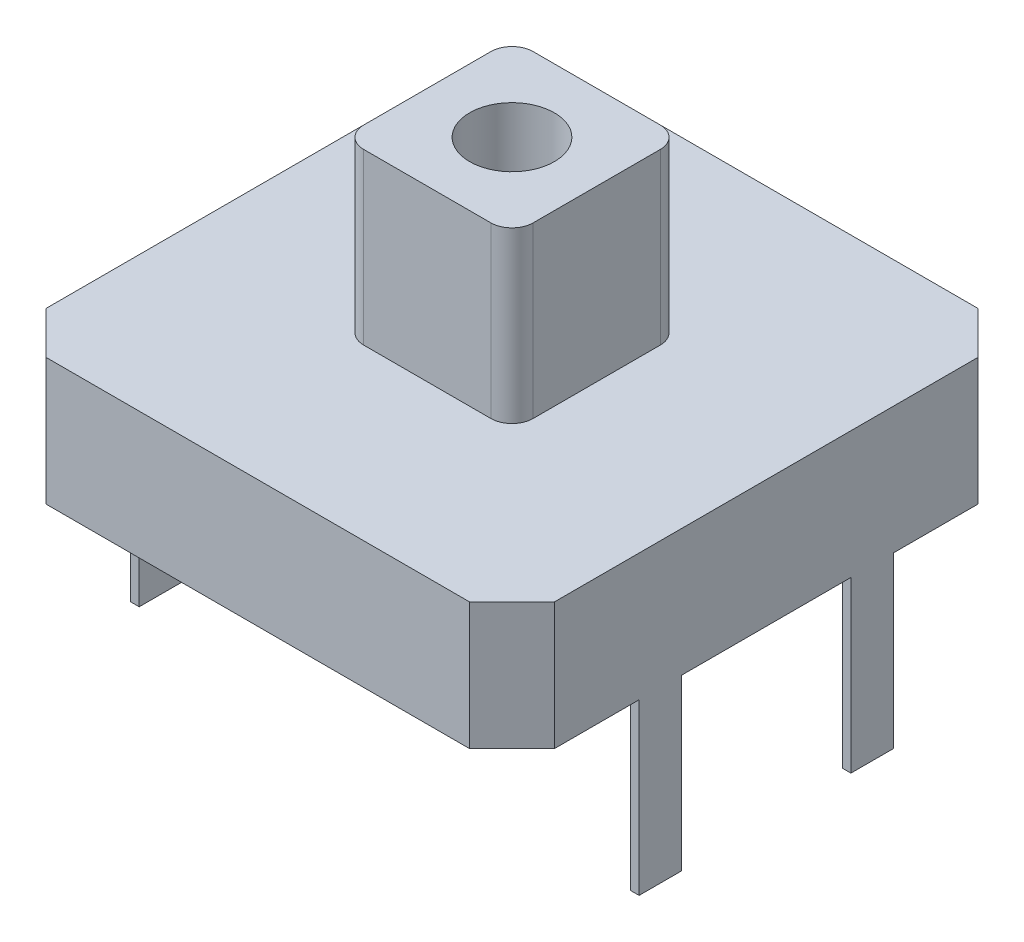
ISO-10303-21;
HEADER;
FILE_DESCRIPTION(('STEP AP214'),'2;1');
FILE_NAME('part.step','',(''),(''),'','','');
FILE_SCHEMA(('AUTOMOTIVE_DESIGN { 1 0 10303 214 1 1 1 1 }'));
ENDSEC;
DATA;
#1=APPLICATION_CONTEXT('core data for automotive mechanical design processes');
#2=APPLICATION_PROTOCOL_DEFINITION('international standard','automotive_design',2000,#1);
#3=PRODUCT_CONTEXT('',#1,'mechanical');
#4=PRODUCT('Part','Part','',(#3));
#5=PRODUCT_RELATED_PRODUCT_CATEGORY('part','',(#4));
#6=PRODUCT_DEFINITION_FORMATION('','',#4);
#7=PRODUCT_DEFINITION_CONTEXT('part definition',#1,'design');
#8=PRODUCT_DEFINITION('design','',#6,#7);
#9=PRODUCT_DEFINITION_SHAPE('','',#8);
#10=(LENGTH_UNIT() NAMED_UNIT(*) SI_UNIT(.MILLI.,.METRE.));
#11=(NAMED_UNIT(*) PLANE_ANGLE_UNIT() SI_UNIT($,.RADIAN.));
#12=(NAMED_UNIT(*) SI_UNIT($,.STERADIAN.) SOLID_ANGLE_UNIT());
#13=UNCERTAINTY_MEASURE_WITH_UNIT(LENGTH_MEASURE(1.E-05),#10,'distance_accuracy_value','');
#14=(GEOMETRIC_REPRESENTATION_CONTEXT(3) GLOBAL_UNCERTAINTY_ASSIGNED_CONTEXT((#13)) GLOBAL_UNIT_ASSIGNED_CONTEXT((#10,
#11,#12)) REPRESENTATION_CONTEXT('',''));
#15=CARTESIAN_POINT('',(0.,0.,0.));
#16=DIRECTION('',(0.,0.,1.));
#17=DIRECTION('',(1.,0.,0.));
#18=AXIS2_PLACEMENT_3D('',#15,#16,#17);
#19=CARTESIAN_POINT('',(0.,0.,0.));
#20=DIRECTION('',(0.,-1.,0.));
#21=DIRECTION('',(0.,0.,-1.));
#22=AXIS2_PLACEMENT_3D('',#19,#20,#21);
#23=PLANE('',#22);
#24=DIRECTION('',(1.,0.,0.));
#25=VECTOR('',#24,1.);
#26=CARTESIAN_POINT('',(-6.,0.,6.));
#27=LINE('',#26,#25);
#28=CARTESIAN_POINT('',(-5.,0.,6.));
#29=VERTEX_POINT('',#28);
#30=CARTESIAN_POINT('',(5.,0.,6.));
#31=VERTEX_POINT('',#30);
#32=EDGE_CURVE('E307',#29,#31,#27,.T.);
#33=ORIENTED_EDGE('',*,*,#32,.F.);
#34=DIRECTION('',(0.707106781186546,0.,0.707106781186549));
#35=VECTOR('',#34,1.);
#36=CARTESIAN_POINT('',(-5.50000000000001,0.,5.49999999999999));
#37=LINE('',#36,#35);
#38=CARTESIAN_POINT('',(-6.,0.,5.));
#39=VERTEX_POINT('',#38);
#40=EDGE_CURVE('E381',#29,#39,#37,.F.);
#41=ORIENTED_EDGE('',*,*,#40,.T.);
#42=DIRECTION('',(0.,0.,1.));
#43=VECTOR('',#42,1.);
#44=CARTESIAN_POINT('',(-6.,0.,6.));
#45=LINE('',#44,#43);
#46=CARTESIAN_POINT('',(-6.,0.,3.));
#47=VERTEX_POINT('',#46);
#48=EDGE_CURVE('E303',#47,#39,#45,.T.);
#49=ORIENTED_EDGE('',*,*,#48,.F.);
#50=DIRECTION('',(-1.,0.,0.));
#51=VECTOR('',#50,1.);
#52=CARTESIAN_POINT('',(-6.,0.,3.));
#53=LINE('',#52,#51);
#54=CARTESIAN_POINT('',(-5.8,0.,3.));
#55=VERTEX_POINT('',#54);
#56=EDGE_CURVE('E501',#55,#47,#53,.T.);
#57=ORIENTED_EDGE('',*,*,#56,.F.);
#58=DIRECTION('',(0.,0.,1.));
#59=VECTOR('',#58,1.);
#60=CARTESIAN_POINT('',(-5.8,0.,2.));
#61=LINE('',#60,#59);
#62=CARTESIAN_POINT('',(-5.8,0.,2.));
#63=VERTEX_POINT('',#62);
#64=EDGE_CURVE('E505',#63,#55,#61,.T.);
#65=ORIENTED_EDGE('',*,*,#64,.F.);
#66=DIRECTION('',(1.,0.,0.));
#67=VECTOR('',#66,1.);
#68=CARTESIAN_POINT('',(-6.,0.,2.));
#69=LINE('',#68,#67);
#70=CARTESIAN_POINT('',(-6.,0.,2.));
#71=VERTEX_POINT('',#70);
#72=EDGE_CURVE('E496',#71,#63,#69,.T.);
#73=ORIENTED_EDGE('',*,*,#72,.F.);
#74=CARTESIAN_POINT('',(-6.,0.,-2.));
#75=VERTEX_POINT('',#74);
#76=EDGE_CURVE('E308',#75,#71,#45,.T.);
#77=ORIENTED_EDGE('',*,*,#76,.F.);
#78=DIRECTION('',(-1.,0.,0.));
#79=VECTOR('',#78,1.);
#80=CARTESIAN_POINT('',(-6.,0.,-2.));
#81=LINE('',#80,#79);
#82=CARTESIAN_POINT('',(-5.8,0.,-2.));
#83=VERTEX_POINT('',#82);
#84=EDGE_CURVE('E525',#83,#75,#81,.T.);
#85=ORIENTED_EDGE('',*,*,#84,.F.);
#86=DIRECTION('',(0.,0.,1.));
#87=VECTOR('',#86,1.);
#88=CARTESIAN_POINT('',(-5.8,0.,-2.));
#89=LINE('',#88,#87);
#90=CARTESIAN_POINT('',(-5.8,0.,-3.));
#91=VERTEX_POINT('',#90);
#92=EDGE_CURVE('E538',#91,#83,#89,.T.);
#93=ORIENTED_EDGE('',*,*,#92,.F.);
#94=DIRECTION('',(1.,0.,0.));
#95=VECTOR('',#94,1.);
#96=CARTESIAN_POINT('',(-6.,0.,-3.));
#97=LINE('',#96,#95);
#98=CARTESIAN_POINT('',(-6.,0.,-3.));
#99=VERTEX_POINT('',#98);
#100=EDGE_CURVE('E509',#99,#91,#97,.T.);
#101=ORIENTED_EDGE('',*,*,#100,.F.);
#102=CARTESIAN_POINT('',(-6.,0.,-5.));
#103=VERTEX_POINT('',#102);
#104=EDGE_CURVE('E304',#103,#99,#45,.T.);
#105=ORIENTED_EDGE('',*,*,#104,.F.);
#106=DIRECTION('',(-0.707106781186549,0.,0.707106781186546));
#107=VECTOR('',#106,1.);
#108=CARTESIAN_POINT('',(-5.49999999999999,0.,-5.50000000000001));
#109=LINE('',#108,#107);
#110=CARTESIAN_POINT('',(-4.99999999999999,0.,-6.));
#111=VERTEX_POINT('',#110);
#112=EDGE_CURVE('E375',#103,#111,#109,.F.);
#113=ORIENTED_EDGE('',*,*,#112,.T.);
#114=DIRECTION('',(-1.,0.,0.));
#115=VECTOR('',#114,1.);
#116=CARTESIAN_POINT('',(-6.,0.,-6.));
#117=LINE('',#116,#115);
#118=CARTESIAN_POINT('',(5.,0.,-6.));
#119=VERTEX_POINT('',#118);
#120=EDGE_CURVE('E294',#119,#111,#117,.T.);
#121=ORIENTED_EDGE('',*,*,#120,.F.);
#122=DIRECTION('',(-0.707106781186546,0.,-0.707106781186549));
#123=VECTOR('',#122,1.);
#124=CARTESIAN_POINT('',(5.50000000000001,0.,-5.49999999999999));
#125=LINE('',#124,#123);
#126=CARTESIAN_POINT('',(6.,0.,-5.));
#127=VERTEX_POINT('',#126);
#128=EDGE_CURVE('E372',#119,#127,#125,.F.);
#129=ORIENTED_EDGE('',*,*,#128,.T.);
#130=DIRECTION('',(0.,0.,-1.));
#131=VECTOR('',#130,1.);
#132=CARTESIAN_POINT('',(6.,0.,6.));
#133=LINE('',#132,#131);
#134=CARTESIAN_POINT('',(6.,0.,-3.));
#135=VERTEX_POINT('',#134);
#136=EDGE_CURVE('E290',#135,#127,#133,.T.);
#137=ORIENTED_EDGE('',*,*,#136,.F.);
#138=DIRECTION('',(1.,0.,0.));
#139=VECTOR('',#138,1.);
#140=CARTESIAN_POINT('',(6.,0.,-3.));
#141=LINE('',#140,#139);
#142=CARTESIAN_POINT('',(5.8,0.,-3.));
#143=VERTEX_POINT('',#142);
#144=EDGE_CURVE('E594',#143,#135,#141,.T.);
#145=ORIENTED_EDGE('',*,*,#144,.F.);
#146=DIRECTION('',(0.,0.,-1.));
#147=VECTOR('',#146,1.);
#148=CARTESIAN_POINT('',(5.8,0.,-2.));
#149=LINE('',#148,#147);
#150=CARTESIAN_POINT('',(5.8,0.,-2.));
#151=VERTEX_POINT('',#150);
#152=EDGE_CURVE('E278',#151,#143,#149,.T.);
#153=ORIENTED_EDGE('',*,*,#152,.F.);
#154=DIRECTION('',(-1.,0.,0.));
#155=VECTOR('',#154,1.);
#156=CARTESIAN_POINT('',(6.,0.,-2.));
#157=LINE('',#156,#155);
#158=CARTESIAN_POINT('',(6.,0.,-2.));
#159=VERTEX_POINT('',#158);
#160=EDGE_CURVE('E261',#159,#151,#157,.T.);
#161=ORIENTED_EDGE('',*,*,#160,.F.);
#162=CARTESIAN_POINT('',(6.,0.,2.));
#163=VERTEX_POINT('',#162);
#164=EDGE_CURVE('E276',#163,#159,#133,.T.);
#165=ORIENTED_EDGE('',*,*,#164,.F.);
#166=DIRECTION('',(1.,0.,0.));
#167=VECTOR('',#166,1.);
#168=CARTESIAN_POINT('',(6.,0.,2.));
#169=LINE('',#168,#167);
#170=CARTESIAN_POINT('',(5.8,0.,2.));
#171=VERTEX_POINT('',#170);
#172=EDGE_CURVE('E562',#171,#163,#169,.T.);
#173=ORIENTED_EDGE('',*,*,#172,.F.);
#174=DIRECTION('',(0.,0.,-1.));
#175=VECTOR('',#174,1.);
#176=CARTESIAN_POINT('',(5.8,0.,2.));
#177=LINE('',#176,#175);
#178=CARTESIAN_POINT('',(5.8,0.,3.));
#179=VERTEX_POINT('',#178);
#180=EDGE_CURVE('E574',#179,#171,#177,.T.);
#181=ORIENTED_EDGE('',*,*,#180,.F.);
#182=DIRECTION('',(-1.,0.,0.));
#183=VECTOR('',#182,1.);
#184=CARTESIAN_POINT('',(6.,0.,3.));
#185=LINE('',#184,#183);
#186=CARTESIAN_POINT('',(6.,0.,3.));
#187=VERTEX_POINT('',#186);
#188=EDGE_CURVE('E557',#187,#179,#185,.T.);
#189=ORIENTED_EDGE('',*,*,#188,.F.);
#190=CARTESIAN_POINT('',(6.,0.,5.));
#191=VERTEX_POINT('',#190);
#192=EDGE_CURVE('E289',#191,#187,#133,.T.);
#193=ORIENTED_EDGE('',*,*,#192,.F.);
#194=DIRECTION('',(0.707106781186549,0.,-0.707106781186546));
#195=VECTOR('',#194,1.);
#196=CARTESIAN_POINT('',(5.49999999999999,0.,5.50000000000001));
#197=LINE('',#196,#195);
#198=EDGE_CURVE('E378',#191,#31,#197,.F.);
#199=ORIENTED_EDGE('',*,*,#198,.T.);
#200=EDGE_LOOP('',(#33,#41,#49,#57,#65,#73,#77,#85,#93,#101,#105,#113,#121,#129,#137,#145,#153,
#161,#165,#173,#181,#189,#193,#199));
#201=FACE_BOUND('',#200,.T.);
#202=ADVANCED_FACE('F45',(#201),#23,.T.);
#203=CARTESIAN_POINT('',(0.,3.,0.));
#204=DIRECTION('',(0.,-1.,0.));
#205=DIRECTION('',(0.,0.,-1.));
#206=AXIS2_PLACEMENT_3D('',#203,#204,#205);
#207=PLANE('',#206);
#208=DIRECTION('',(0.,0.,1.));
#209=VECTOR('',#208,1.);
#210=CARTESIAN_POINT('',(-6.,3.,6.));
#211=LINE('',#210,#209);
#212=CARTESIAN_POINT('',(-6.,3.,-5.));
#213=VERTEX_POINT('',#212);
#214=CARTESIAN_POINT('',(-6.,3.,5.));
#215=VERTEX_POINT('',#214);
#216=EDGE_CURVE('E429',#213,#215,#211,.T.);
#217=ORIENTED_EDGE('',*,*,#216,.T.);
#218=DIRECTION('',(-0.707106781186546,0.,-0.707106781186549));
#219=VECTOR('',#218,1.);
#220=CARTESIAN_POINT('',(-5.,3.,6.));
#221=LINE('',#220,#219);
#222=CARTESIAN_POINT('',(-5.,3.,6.));
#223=VERTEX_POINT('',#222);
#224=EDGE_CURVE('E399',#215,#223,#221,.F.);
#225=ORIENTED_EDGE('',*,*,#224,.T.);
#226=DIRECTION('',(1.,0.,0.));
#227=VECTOR('',#226,1.);
#228=CARTESIAN_POINT('',(-6.,3.,6.));
#229=LINE('',#228,#227);
#230=CARTESIAN_POINT('',(5.,3.,6.));
#231=VERTEX_POINT('',#230);
#232=EDGE_CURVE('E299',#223,#231,#229,.T.);
#233=ORIENTED_EDGE('',*,*,#232,.T.);
#234=DIRECTION('',(-0.707106781186549,0.,0.707106781186546));
#235=VECTOR('',#234,1.);
#236=CARTESIAN_POINT('',(6.,3.,5.));
#237=LINE('',#236,#235);
#238=CARTESIAN_POINT('',(6.,3.,5.));
#239=VERTEX_POINT('',#238);
#240=EDGE_CURVE('E396',#231,#239,#237,.F.);
#241=ORIENTED_EDGE('',*,*,#240,.T.);
#242=DIRECTION('',(0.,0.,-1.));
#243=VECTOR('',#242,1.);
#244=CARTESIAN_POINT('',(6.,3.,6.));
#245=LINE('',#244,#243);
#246=CARTESIAN_POINT('',(6.,3.,-5.));
#247=VERTEX_POINT('',#246);
#248=EDGE_CURVE('E312',#239,#247,#245,.T.);
#249=ORIENTED_EDGE('',*,*,#248,.T.);
#250=DIRECTION('',(0.707106781186546,0.,0.707106781186549));
#251=VECTOR('',#250,1.);
#252=CARTESIAN_POINT('',(5.,3.,-6.));
#253=LINE('',#252,#251);
#254=CARTESIAN_POINT('',(5.,3.,-6.));
#255=VERTEX_POINT('',#254);
#256=EDGE_CURVE('E67',#247,#255,#253,.F.);
#257=ORIENTED_EDGE('',*,*,#256,.T.);
#258=DIRECTION('',(-1.,0.,0.));
#259=VECTOR('',#258,1.);
#260=CARTESIAN_POINT('',(-6.,3.,-6.));
#261=LINE('',#260,#259);
#262=CARTESIAN_POINT('',(-4.99999999999999,3.,-6.));
#263=VERTEX_POINT('',#262);
#264=EDGE_CURVE('E413',#255,#263,#261,.T.);
#265=ORIENTED_EDGE('',*,*,#264,.T.);
#266=DIRECTION('',(0.707106781186549,0.,-0.707106781186546));
#267=VECTOR('',#266,1.);
#268=CARTESIAN_POINT('',(-6.,3.,-5.));
#269=LINE('',#268,#267);
#270=EDGE_CURVE('E393',#263,#213,#269,.F.);
#271=ORIENTED_EDGE('',*,*,#270,.T.);
#272=EDGE_LOOP('',(#217,#225,#233,#241,#249,#257,#265,#271));
#273=FACE_BOUND('',#272,.T.);
#274=DIRECTION('',(0.,0.,-1.));
#275=VECTOR('',#274,1.);
#276=CARTESIAN_POINT('',(2.,3.,2.));
#277=LINE('',#276,#275);
#278=CARTESIAN_POINT('',(2.,3.,1.5));
#279=VERTEX_POINT('',#278);
#280=CARTESIAN_POINT('',(2.,3.,-1.5));
#281=VERTEX_POINT('',#280);
#282=EDGE_CURVE('E453',#279,#281,#277,.T.);
#283=ORIENTED_EDGE('',*,*,#282,.F.);
#284=CARTESIAN_POINT('',(1.5,3.,1.5));
#285=DIRECTION('',(0.,-1.,0.));
#286=DIRECTION('',(0.,0.,-1.));
#287=AXIS2_PLACEMENT_3D('',#284,#285,#286);
#288=CIRCLE('',#287,0.5);
#289=CARTESIAN_POINT('',(1.5,3.,2.));
#290=VERTEX_POINT('',#289);
#291=EDGE_CURVE('E362',#279,#290,#288,.T.);
#292=ORIENTED_EDGE('',*,*,#291,.T.);
#293=DIRECTION('',(1.,0.,0.));
#294=VECTOR('',#293,1.);
#295=CARTESIAN_POINT('',(-2.,3.,2.));
#296=LINE('',#295,#294);
#297=CARTESIAN_POINT('',(-1.5,3.,2.));
#298=VERTEX_POINT('',#297);
#299=EDGE_CURVE('E440',#298,#290,#296,.T.);
#300=ORIENTED_EDGE('',*,*,#299,.F.);
#301=CARTESIAN_POINT('',(-1.5,3.,1.5));
#302=DIRECTION('',(0.,-1.,0.));
#303=DIRECTION('',(0.,0.,-1.));
#304=AXIS2_PLACEMENT_3D('',#301,#302,#303);
#305=CIRCLE('',#304,0.5);
#306=CARTESIAN_POINT('',(-2.,3.,1.5));
#307=VERTEX_POINT('',#306);
#308=EDGE_CURVE('E359',#298,#307,#305,.T.);
#309=ORIENTED_EDGE('',*,*,#308,.T.);
#310=DIRECTION('',(0.,0.,1.));
#311=VECTOR('',#310,1.);
#312=CARTESIAN_POINT('',(-2.,3.,2.));
#313=LINE('',#312,#311);
#314=CARTESIAN_POINT('',(-2.,3.,-1.5));
#315=VERTEX_POINT('',#314);
#316=EDGE_CURVE('E445',#315,#307,#313,.T.);
#317=ORIENTED_EDGE('',*,*,#316,.F.);
#318=CARTESIAN_POINT('',(-1.5,3.,-1.5));
#319=DIRECTION('',(0.,-1.,0.));
#320=DIRECTION('',(0.,0.,-1.));
#321=AXIS2_PLACEMENT_3D('',#318,#319,#320);
#322=CIRCLE('',#321,0.5);
#323=CARTESIAN_POINT('',(-1.5,3.,-2.));
#324=VERTEX_POINT('',#323);
#325=EDGE_CURVE('E356',#315,#324,#322,.T.);
#326=ORIENTED_EDGE('',*,*,#325,.T.);
#327=DIRECTION('',(-1.,0.,0.));
#328=VECTOR('',#327,1.);
#329=CARTESIAN_POINT('',(-2.,3.,-2.));
#330=LINE('',#329,#328);
#331=CARTESIAN_POINT('',(1.5,3.,-2.));
#332=VERTEX_POINT('',#331);
#333=EDGE_CURVE('E449',#332,#324,#330,.T.);
#334=ORIENTED_EDGE('',*,*,#333,.F.);
#335=CARTESIAN_POINT('',(1.5,3.,-1.5));
#336=DIRECTION('',(0.,-1.,0.));
#337=DIRECTION('',(0.,0.,-1.));
#338=AXIS2_PLACEMENT_3D('',#335,#336,#337);
#339=CIRCLE('',#338,0.5);
#340=EDGE_CURVE('E353',#332,#281,#339,.T.);
#341=ORIENTED_EDGE('',*,*,#340,.T.);
#342=EDGE_LOOP('',(#283,#292,#300,#309,#317,#326,#334,#341));
#343=FACE_BOUND('',#342,.T.);
#344=ADVANCED_FACE('F636',(#273,#343),#207,.F.);
#345=CARTESIAN_POINT('',(6.,3.,6.));
#346=DIRECTION('',(-1.,0.,0.));
#347=DIRECTION('',(0.,0.,1.));
#348=AXIS2_PLACEMENT_3D('',#345,#346,#347);
#349=PLANE('',#348);
#350=ORIENTED_EDGE('',*,*,#248,.F.);
#351=DIRECTION('',(0.,-1.,0.));
#352=VECTOR('',#351,1.);
#353=CARTESIAN_POINT('',(6.,3.,5.));
#354=LINE('',#353,#352);
#355=EDGE_CURVE('E405',#239,#191,#354,.T.);
#356=ORIENTED_EDGE('',*,*,#355,.T.);
#357=ORIENTED_EDGE('',*,*,#192,.T.);
#358=DIRECTION('',(0.,1.,0.));
#359=VECTOR('',#358,1.);
#360=CARTESIAN_POINT('',(6.,-4.,3.));
#361=LINE('',#360,#359);
#362=CARTESIAN_POINT('',(6.,-4.,3.));
#363=VERTEX_POINT('',#362);
#364=EDGE_CURVE('E280',#363,#187,#361,.T.);
#365=ORIENTED_EDGE('',*,*,#364,.F.);
#366=DIRECTION('',(0.,0.,1.));
#367=VECTOR('',#366,1.);
#368=CARTESIAN_POINT('',(6.,-4.,2.));
#369=LINE('',#368,#367);
#370=CARTESIAN_POINT('',(6.,-4.,2.));
#371=VERTEX_POINT('',#370);
#372=EDGE_CURVE('E558',#371,#363,#369,.T.);
#373=ORIENTED_EDGE('',*,*,#372,.F.);
#374=DIRECTION('',(0.,1.,0.));
#375=VECTOR('',#374,1.);
#376=CARTESIAN_POINT('',(6.,-4.,2.));
#377=LINE('',#376,#375);
#378=EDGE_CURVE('E286',#371,#163,#377,.T.);
#379=ORIENTED_EDGE('',*,*,#378,.T.);
#380=ORIENTED_EDGE('',*,*,#164,.T.);
#381=DIRECTION('',(0.,1.,0.));
#382=VECTOR('',#381,1.);
#383=CARTESIAN_POINT('',(6.,-4.,-2.));
#384=LINE('',#383,#382);
#385=CARTESIAN_POINT('',(6.,-4.,-2.));
#386=VERTEX_POINT('',#385);
#387=EDGE_CURVE('E257',#386,#159,#384,.T.);
#388=ORIENTED_EDGE('',*,*,#387,.F.);
#389=DIRECTION('',(0.,0.,1.));
#390=VECTOR('',#389,1.);
#391=CARTESIAN_POINT('',(6.,-4.,-2.));
#392=LINE('',#391,#390);
#393=CARTESIAN_POINT('',(6.,-4.,-3.));
#394=VERTEX_POINT('',#393);
#395=EDGE_CURVE('E269',#394,#386,#392,.T.);
#396=ORIENTED_EDGE('',*,*,#395,.F.);
#397=DIRECTION('',(0.,1.,0.));
#398=VECTOR('',#397,1.);
#399=CARTESIAN_POINT('',(6.,-4.,-3.));
#400=LINE('',#399,#398);
#401=EDGE_CURVE('E270',#394,#135,#400,.T.);
#402=ORIENTED_EDGE('',*,*,#401,.T.);
#403=ORIENTED_EDGE('',*,*,#136,.T.);
#404=DIRECTION('',(0.,1.,0.));
#405=VECTOR('',#404,1.);
#406=CARTESIAN_POINT('',(6.,3.,-5.));
#407=LINE('',#406,#405);
#408=EDGE_CURVE('E402',#127,#247,#407,.T.);
#409=ORIENTED_EDGE('',*,*,#408,.T.);
#410=EDGE_LOOP('',(#350,#356,#357,#365,#373,#379,#380,#388,#396,#402,#403,#409));
#411=FACE_BOUND('',#410,.T.);
#412=ADVANCED_FACE('F283',(#411),#349,.F.);
#413=CARTESIAN_POINT('',(-6.,3.,-6.));
#414=DIRECTION('',(0.,0.,1.));
#415=DIRECTION('',(1.,0.,0.));
#416=AXIS2_PLACEMENT_3D('',#413,#414,#415);
#417=PLANE('',#416);
#418=ORIENTED_EDGE('',*,*,#120,.T.);
#419=DIRECTION('',(0.,1.,0.));
#420=VECTOR('',#419,1.);
#421=CARTESIAN_POINT('',(-4.99999999999999,3.,-6.));
#422=LINE('',#421,#420);
#423=EDGE_CURVE('E11',#111,#263,#422,.T.);
#424=ORIENTED_EDGE('',*,*,#423,.T.);
#425=ORIENTED_EDGE('',*,*,#264,.F.);
#426=DIRECTION('',(0.,-1.,0.));
#427=VECTOR('',#426,1.);
#428=CARTESIAN_POINT('',(5.,3.,-6.));
#429=LINE('',#428,#427);
#430=EDGE_CURVE('E55',#255,#119,#429,.T.);
#431=ORIENTED_EDGE('',*,*,#430,.T.);
#432=EDGE_LOOP('',(#418,#424,#425,#431));
#433=FACE_BOUND('',#432,.T.);
#434=ADVANCED_FACE('F412',(#433),#417,.F.);
#435=CARTESIAN_POINT('',(-6.,3.,6.));
#436=DIRECTION('',(1.,0.,0.));
#437=DIRECTION('',(0.,0.,-1.));
#438=AXIS2_PLACEMENT_3D('',#435,#436,#437);
#439=PLANE('',#438);
#440=ORIENTED_EDGE('',*,*,#48,.T.);
#441=DIRECTION('',(0.,1.,0.));
#442=VECTOR('',#441,1.);
#443=CARTESIAN_POINT('',(-6.,3.,5.));
#444=LINE('',#443,#442);
#445=EDGE_CURVE('E388',#39,#215,#444,.T.);
#446=ORIENTED_EDGE('',*,*,#445,.T.);
#447=ORIENTED_EDGE('',*,*,#216,.F.);
#448=DIRECTION('',(0.,-1.,0.));
#449=VECTOR('',#448,1.);
#450=CARTESIAN_POINT('',(-6.,3.,-5.));
#451=LINE('',#450,#449);
#452=EDGE_CURVE('E384',#213,#103,#451,.T.);
#453=ORIENTED_EDGE('',*,*,#452,.T.);
#454=ORIENTED_EDGE('',*,*,#104,.T.);
#455=DIRECTION('',(0.,1.,0.));
#456=VECTOR('',#455,1.);
#457=CARTESIAN_POINT('',(-6.,-4.,-3.));
#458=LINE('',#457,#456);
#459=CARTESIAN_POINT('',(-6.,-4.,-3.));
#460=VERTEX_POINT('',#459);
#461=EDGE_CURVE('E554',#460,#99,#458,.T.);
#462=ORIENTED_EDGE('',*,*,#461,.F.);
#463=DIRECTION('',(0.,0.,-1.));
#464=VECTOR('',#463,1.);
#465=CARTESIAN_POINT('',(-6.,-4.,-2.));
#466=LINE('',#465,#464);
#467=CARTESIAN_POINT('',(-6.,-4.,-2.));
#468=VERTEX_POINT('',#467);
#469=EDGE_CURVE('E521',#468,#460,#466,.T.);
#470=ORIENTED_EDGE('',*,*,#469,.F.);
#471=DIRECTION('',(0.,1.,0.));
#472=VECTOR('',#471,1.);
#473=CARTESIAN_POINT('',(-6.,-4.,-2.));
#474=LINE('',#473,#472);
#475=EDGE_CURVE('E535',#468,#75,#474,.T.);
#476=ORIENTED_EDGE('',*,*,#475,.T.);
#477=ORIENTED_EDGE('',*,*,#76,.T.);
#478=DIRECTION('',(0.,1.,0.));
#479=VECTOR('',#478,1.);
#480=CARTESIAN_POINT('',(-6.,-4.,2.));
#481=LINE('',#480,#479);
#482=CARTESIAN_POINT('',(-6.,-4.,2.));
#483=VERTEX_POINT('',#482);
#484=EDGE_CURVE('E487',#483,#71,#481,.T.);
#485=ORIENTED_EDGE('',*,*,#484,.F.);
#486=DIRECTION('',(0.,0.,-1.));
#487=VECTOR('',#486,1.);
#488=CARTESIAN_POINT('',(-6.,-4.,2.));
#489=LINE('',#488,#487);
#490=CARTESIAN_POINT('',(-6.,-4.,3.));
#491=VERTEX_POINT('',#490);
#492=EDGE_CURVE('E512',#491,#483,#489,.T.);
#493=ORIENTED_EDGE('',*,*,#492,.F.);
#494=DIRECTION('',(0.,1.,0.));
#495=VECTOR('',#494,1.);
#496=CARTESIAN_POINT('',(-6.,-4.,3.));
#497=LINE('',#496,#495);
#498=EDGE_CURVE('E483',#491,#47,#497,.T.);
#499=ORIENTED_EDGE('',*,*,#498,.T.);
#500=EDGE_LOOP('',(#440,#446,#447,#453,#454,#462,#470,#476,#477,#485,#493,#499));
#501=FACE_BOUND('',#500,.T.);
#502=ADVANCED_FACE('F425',(#501),#439,.F.);
#503=CARTESIAN_POINT('',(-6.,3.,6.));
#504=DIRECTION('',(0.,0.,-1.));
#505=DIRECTION('',(-1.,0.,0.));
#506=AXIS2_PLACEMENT_3D('',#503,#504,#505);
#507=PLANE('',#506);
#508=ORIENTED_EDGE('',*,*,#232,.F.);
#509=DIRECTION('',(0.,-1.,0.));
#510=VECTOR('',#509,1.);
#511=CARTESIAN_POINT('',(-5.,3.,6.));
#512=LINE('',#511,#510);
#513=EDGE_CURVE('E368',#223,#29,#512,.T.);
#514=ORIENTED_EDGE('',*,*,#513,.T.);
#515=ORIENTED_EDGE('',*,*,#32,.T.);
#516=DIRECTION('',(0.,1.,0.));
#517=VECTOR('',#516,1.);
#518=CARTESIAN_POINT('',(5.,3.,6.));
#519=LINE('',#518,#517);
#520=EDGE_CURVE('E365',#31,#231,#519,.T.);
#521=ORIENTED_EDGE('',*,*,#520,.T.);
#522=EDGE_LOOP('',(#508,#514,#515,#521));
#523=FACE_BOUND('',#522,.T.);
#524=ADVANCED_FACE('F644',(#523),#507,.F.);
#525=CARTESIAN_POINT('',(2.,7.,2.));
#526=DIRECTION('',(-1.,0.,0.));
#527=DIRECTION('',(0.,0.,1.));
#528=AXIS2_PLACEMENT_3D('',#525,#526,#527);
#529=PLANE('',#528);
#530=ORIENTED_EDGE('',*,*,#282,.T.);
#531=DIRECTION('',(0.,-1.,0.));
#532=VECTOR('',#531,1.);
#533=CARTESIAN_POINT('',(2.,7.,-1.5));
#534=LINE('',#533,#532);
#535=CARTESIAN_POINT('',(2.,7.,-1.5));
#536=VERTEX_POINT('',#535);
#537=EDGE_CURVE('E324',#281,#536,#534,.F.);
#538=ORIENTED_EDGE('',*,*,#537,.T.);
#539=DIRECTION('',(0.,0.,-1.));
#540=VECTOR('',#539,1.);
#541=CARTESIAN_POINT('',(2.,7.,2.));
#542=LINE('',#541,#540);
#543=CARTESIAN_POINT('',(2.,7.,1.5));
#544=VERTEX_POINT('',#543);
#545=EDGE_CURVE('E444',#544,#536,#542,.T.);
#546=ORIENTED_EDGE('',*,*,#545,.F.);
#547=DIRECTION('',(0.,-1.,0.));
#548=VECTOR('',#547,1.);
#549=CARTESIAN_POINT('',(2.,7.,1.5));
#550=LINE('',#549,#548);
#551=EDGE_CURVE('E320',#544,#279,#550,.T.);
#552=ORIENTED_EDGE('',*,*,#551,.T.);
#553=EDGE_LOOP('',(#530,#538,#546,#552));
#554=FACE_BOUND('',#553,.T.);
#555=ADVANCED_FACE('F647',(#554),#529,.F.);
#556=CARTESIAN_POINT('',(-2.,7.,-2.));
#557=DIRECTION('',(0.,0.,1.));
#558=DIRECTION('',(1.,0.,0.));
#559=AXIS2_PLACEMENT_3D('',#556,#557,#558);
#560=PLANE('',#559);
#561=DIRECTION('',(-1.,0.,0.));
#562=VECTOR('',#561,1.);
#563=CARTESIAN_POINT('',(-2.,7.,-2.));
#564=LINE('',#563,#562);
#565=CARTESIAN_POINT('',(1.5,7.,-2.));
#566=VERTEX_POINT('',#565);
#567=CARTESIAN_POINT('',(-1.5,7.,-2.));
#568=VERTEX_POINT('',#567);
#569=EDGE_CURVE('E465',#566,#568,#564,.T.);
#570=ORIENTED_EDGE('',*,*,#569,.F.);
#571=DIRECTION('',(0.,-1.,0.));
#572=VECTOR('',#571,1.);
#573=CARTESIAN_POINT('',(1.5,7.,-2.));
#574=LINE('',#573,#572);
#575=EDGE_CURVE('E316',#566,#332,#574,.T.);
#576=ORIENTED_EDGE('',*,*,#575,.T.);
#577=ORIENTED_EDGE('',*,*,#333,.T.);
#578=DIRECTION('',(0.,-1.,0.));
#579=VECTOR('',#578,1.);
#580=CARTESIAN_POINT('',(-1.5,7.,-2.));
#581=LINE('',#580,#579);
#582=EDGE_CURVE('E313',#324,#568,#581,.F.);
#583=ORIENTED_EDGE('',*,*,#582,.T.);
#584=EDGE_LOOP('',(#570,#576,#577,#583));
#585=FACE_BOUND('',#584,.T.);
#586=ADVANCED_FACE('F774',(#585),#560,.F.);
#587=CARTESIAN_POINT('',(-2.,7.,2.));
#588=DIRECTION('',(1.,0.,0.));
#589=DIRECTION('',(0.,0.,-1.));
#590=AXIS2_PLACEMENT_3D('',#587,#588,#589);
#591=PLANE('',#590);
#592=DIRECTION('',(0.,0.,1.));
#593=VECTOR('',#592,1.);
#594=CARTESIAN_POINT('',(-2.,7.,2.));
#595=LINE('',#594,#593);
#596=CARTESIAN_POINT('',(-2.,7.,-1.5));
#597=VERTEX_POINT('',#596);
#598=CARTESIAN_POINT('',(-2.,7.,1.5));
#599=VERTEX_POINT('',#598);
#600=EDGE_CURVE('E461',#597,#599,#595,.T.);
#601=ORIENTED_EDGE('',*,*,#600,.F.);
#602=DIRECTION('',(0.,-1.,0.));
#603=VECTOR('',#602,1.);
#604=CARTESIAN_POINT('',(-2.,7.,-1.5));
#605=LINE('',#604,#603);
#606=EDGE_CURVE('E342',#597,#315,#605,.T.);
#607=ORIENTED_EDGE('',*,*,#606,.T.);
#608=ORIENTED_EDGE('',*,*,#316,.T.);
#609=DIRECTION('',(0.,-1.,0.));
#610=VECTOR('',#609,1.);
#611=CARTESIAN_POINT('',(-2.,7.,1.5));
#612=LINE('',#611,#610);
#613=EDGE_CURVE('E339',#307,#599,#612,.F.);
#614=ORIENTED_EDGE('',*,*,#613,.T.);
#615=EDGE_LOOP('',(#601,#607,#608,#614));
#616=FACE_BOUND('',#615,.T.);
#617=ADVANCED_FACE('F770',(#616),#591,.F.);
#618=CARTESIAN_POINT('',(-2.,7.,2.));
#619=DIRECTION('',(0.,0.,-1.));
#620=DIRECTION('',(-1.,0.,0.));
#621=AXIS2_PLACEMENT_3D('',#618,#619,#620);
#622=PLANE('',#621);
#623=DIRECTION('',(1.,0.,0.));
#624=VECTOR('',#623,1.);
#625=CARTESIAN_POINT('',(-2.,7.,2.));
#626=LINE('',#625,#624);
#627=CARTESIAN_POINT('',(-1.5,7.,2.));
#628=VERTEX_POINT('',#627);
#629=CARTESIAN_POINT('',(1.5,7.,2.));
#630=VERTEX_POINT('',#629);
#631=EDGE_CURVE('E296',#628,#630,#626,.T.);
#632=ORIENTED_EDGE('',*,*,#631,.F.);
#633=DIRECTION('',(0.,-1.,0.));
#634=VECTOR('',#633,1.);
#635=CARTESIAN_POINT('',(-1.5,7.,2.));
#636=LINE('',#635,#634);
#637=EDGE_CURVE('E349',#628,#298,#636,.T.);
#638=ORIENTED_EDGE('',*,*,#637,.T.);
#639=ORIENTED_EDGE('',*,*,#299,.T.);
#640=DIRECTION('',(0.,-1.,0.));
#641=VECTOR('',#640,1.);
#642=CARTESIAN_POINT('',(1.5,7.,2.));
#643=LINE('',#642,#641);
#644=EDGE_CURVE('E346',#290,#630,#643,.F.);
#645=ORIENTED_EDGE('',*,*,#644,.T.);
#646=EDGE_LOOP('',(#632,#638,#639,#645));
#647=FACE_BOUND('',#646,.T.);
#648=ADVANCED_FACE('F766',(#647),#622,.F.);
#649=CARTESIAN_POINT('',(0.,7.,0.));
#650=DIRECTION('',(0.,-1.,0.));
#651=DIRECTION('',(0.,0.,-1.));
#652=AXIS2_PLACEMENT_3D('',#649,#650,#651);
#653=PLANE('',#652);
#654=CARTESIAN_POINT('',(0.,7.,0.));
#655=DIRECTION('',(0.,1.,0.));
#656=DIRECTION('',(0.,0.,1.));
#657=AXIS2_PLACEMENT_3D('',#654,#655,#656);
#658=CIRCLE('',#657,1.);
#659=CARTESIAN_POINT('',(0.,7.,1.));
#660=VERTEX_POINT('',#659);
#661=EDGE_CURVE('E472',#660,#660,#658,.T.);
#662=ORIENTED_EDGE('',*,*,#661,.F.);
#663=EDGE_LOOP('',(#662));
#664=FACE_BOUND('',#663,.T.);
#665=ORIENTED_EDGE('',*,*,#545,.T.);
#666=CARTESIAN_POINT('',(1.5,7.,-1.5));
#667=DIRECTION('',(0.,-1.,0.));
#668=DIRECTION('',(0.,0.,-1.));
#669=AXIS2_PLACEMENT_3D('',#666,#667,#668);
#670=CIRCLE('',#669,0.5);
#671=EDGE_CURVE('E336',#536,#566,#670,.F.);
#672=ORIENTED_EDGE('',*,*,#671,.T.);
#673=ORIENTED_EDGE('',*,*,#569,.T.);
#674=CARTESIAN_POINT('',(-1.5,7.,-1.5));
#675=DIRECTION('',(0.,-1.,0.));
#676=DIRECTION('',(0.,0.,-1.));
#677=AXIS2_PLACEMENT_3D('',#674,#675,#676);
#678=CIRCLE('',#677,0.5);
#679=EDGE_CURVE('E333',#568,#597,#678,.F.);
#680=ORIENTED_EDGE('',*,*,#679,.T.);
#681=ORIENTED_EDGE('',*,*,#600,.T.);
#682=CARTESIAN_POINT('',(-1.5,7.,1.5));
#683=DIRECTION('',(0.,-1.,0.));
#684=DIRECTION('',(0.,0.,-1.));
#685=AXIS2_PLACEMENT_3D('',#682,#683,#684);
#686=CIRCLE('',#685,0.5);
#687=EDGE_CURVE('E330',#599,#628,#686,.F.);
#688=ORIENTED_EDGE('',*,*,#687,.T.);
#689=ORIENTED_EDGE('',*,*,#631,.T.);
#690=CARTESIAN_POINT('',(1.5,7.,1.5));
#691=DIRECTION('',(0.,-1.,0.));
#692=DIRECTION('',(0.,0.,-1.));
#693=AXIS2_PLACEMENT_3D('',#690,#691,#692);
#694=CIRCLE('',#693,0.5);
#695=EDGE_CURVE('E327',#630,#544,#694,.F.);
#696=ORIENTED_EDGE('',*,*,#695,.T.);
#697=EDGE_LOOP('',(#665,#672,#673,#680,#681,#688,#689,#696));
#698=FACE_BOUND('',#697,.T.);
#699=ADVANCED_FACE('F762',(#664,#698),#653,.F.);
#700=CARTESIAN_POINT('',(0.,4.,0.));
#701=DIRECTION('',(0.,1.,0.));
#702=DIRECTION('',(0.,0.,1.));
#703=AXIS2_PLACEMENT_3D('',#700,#701,#702);
#704=CYLINDRICAL_SURFACE('',#703,1.);
#705=CARTESIAN_POINT('',(0.,4.,0.));
#706=DIRECTION('',(0.,1.,0.));
#707=DIRECTION('',(0.,0.,1.));
#708=AXIS2_PLACEMENT_3D('',#705,#706,#707);
#709=CIRCLE('',#708,1.);
#710=CARTESIAN_POINT('',(0.,4.,1.));
#711=VERTEX_POINT('',#710);
#712=EDGE_CURVE('E457',#711,#711,#709,.T.);
#713=ORIENTED_EDGE('',*,*,#712,.F.);
#714=EDGE_LOOP('',(#713));
#715=FACE_BOUND('',#714,.T.);
#716=ORIENTED_EDGE('',*,*,#661,.T.);
#717=EDGE_LOOP('',(#716));
#718=FACE_BOUND('',#717,.T.);
#719=ADVANCED_FACE('F758',(#715,#718),#704,.F.);
#720=CARTESIAN_POINT('',(0.,4.,0.));
#721=DIRECTION('',(0.,1.,0.));
#722=DIRECTION('',(0.,0.,1.));
#723=AXIS2_PLACEMENT_3D('',#720,#721,#722);
#724=PLANE('',#723);
#725=ORIENTED_EDGE('',*,*,#712,.T.);
#726=EDGE_LOOP('',(#725));
#727=FACE_BOUND('',#726,.T.);
#728=ADVANCED_FACE('F659',(#727),#724,.T.);
#729=CARTESIAN_POINT('',(1.5,7.,-1.5));
#730=DIRECTION('',(0.,-1.,0.));
#731=DIRECTION('',(0.,0.,-1.));
#732=AXIS2_PLACEMENT_3D('',#729,#730,#731);
#733=CYLINDRICAL_SURFACE('',#732,0.5);
#734=ORIENTED_EDGE('',*,*,#671,.F.);
#735=ORIENTED_EDGE('',*,*,#537,.F.);
#736=ORIENTED_EDGE('',*,*,#340,.F.);
#737=ORIENTED_EDGE('',*,*,#575,.F.);
#738=EDGE_LOOP('',(#734,#735,#736,#737));
#739=FACE_BOUND('',#738,.T.);
#740=ADVANCED_FACE('F655',(#739),#733,.T.);
#741=CARTESIAN_POINT('',(-1.5,7.,-1.5));
#742=DIRECTION('',(0.,-1.,0.));
#743=DIRECTION('',(0.,0.,-1.));
#744=AXIS2_PLACEMENT_3D('',#741,#742,#743);
#745=CYLINDRICAL_SURFACE('',#744,0.5);
#746=ORIENTED_EDGE('',*,*,#679,.F.);
#747=ORIENTED_EDGE('',*,*,#582,.F.);
#748=ORIENTED_EDGE('',*,*,#325,.F.);
#749=ORIENTED_EDGE('',*,*,#606,.F.);
#750=EDGE_LOOP('',(#746,#747,#748,#749));
#751=FACE_BOUND('',#750,.T.);
#752=ADVANCED_FACE('F658',(#751),#745,.T.);
#753=CARTESIAN_POINT('',(-1.5,7.,1.5));
#754=DIRECTION('',(0.,-1.,0.));
#755=DIRECTION('',(0.,0.,-1.));
#756=AXIS2_PLACEMENT_3D('',#753,#754,#755);
#757=CYLINDRICAL_SURFACE('',#756,0.5);
#758=ORIENTED_EDGE('',*,*,#687,.F.);
#759=ORIENTED_EDGE('',*,*,#613,.F.);
#760=ORIENTED_EDGE('',*,*,#308,.F.);
#761=ORIENTED_EDGE('',*,*,#637,.F.);
#762=EDGE_LOOP('',(#758,#759,#760,#761));
#763=FACE_BOUND('',#762,.T.);
#764=ADVANCED_FACE('F663',(#763),#757,.T.);
#765=CARTESIAN_POINT('',(1.5,7.,1.5));
#766=DIRECTION('',(0.,-1.,0.));
#767=DIRECTION('',(0.,0.,-1.));
#768=AXIS2_PLACEMENT_3D('',#765,#766,#767);
#769=CYLINDRICAL_SURFACE('',#768,0.5);
#770=ORIENTED_EDGE('',*,*,#695,.F.);
#771=ORIENTED_EDGE('',*,*,#644,.F.);
#772=ORIENTED_EDGE('',*,*,#291,.F.);
#773=ORIENTED_EDGE('',*,*,#551,.F.);
#774=EDGE_LOOP('',(#770,#771,#772,#773));
#775=FACE_BOUND('',#774,.T.);
#776=ADVANCED_FACE('F667',(#775),#769,.T.);
#777=CARTESIAN_POINT('',(-5.8,-4.,2.));
#778=DIRECTION('',(-1.,0.,0.));
#779=DIRECTION('',(0.,0.,1.));
#780=AXIS2_PLACEMENT_3D('',#777,#778,#779);
#781=PLANE('',#780);
#782=ORIENTED_EDGE('',*,*,#64,.T.);
#783=DIRECTION('',(0.,1.,0.));
#784=VECTOR('',#783,1.);
#785=CARTESIAN_POINT('',(-5.8,-4.,3.));
#786=LINE('',#785,#784);
#787=CARTESIAN_POINT('',(-5.8,-4.,3.));
#788=VERTEX_POINT('',#787);
#789=EDGE_CURVE('E476',#788,#55,#786,.T.);
#790=ORIENTED_EDGE('',*,*,#789,.F.);
#791=DIRECTION('',(0.,0.,1.));
#792=VECTOR('',#791,1.);
#793=CARTESIAN_POINT('',(-5.8,-4.,2.));
#794=LINE('',#793,#792);
#795=CARTESIAN_POINT('',(-5.8,-4.,2.));
#796=VERTEX_POINT('',#795);
#797=EDGE_CURVE('E500',#796,#788,#794,.T.);
#798=ORIENTED_EDGE('',*,*,#797,.F.);
#799=DIRECTION('',(0.,1.,0.));
#800=VECTOR('',#799,1.);
#801=CARTESIAN_POINT('',(-5.8,-4.,2.));
#802=LINE('',#801,#800);
#803=EDGE_CURVE('E491',#796,#63,#802,.T.);
#804=ORIENTED_EDGE('',*,*,#803,.T.);
#805=EDGE_LOOP('',(#782,#790,#798,#804));
#806=FACE_BOUND('',#805,.T.);
#807=ADVANCED_FACE('F671',(#806),#781,.F.);
#808=CARTESIAN_POINT('',(-6.,-4.,3.));
#809=DIRECTION('',(0.,0.,-1.));
#810=DIRECTION('',(-1.,0.,0.));
#811=AXIS2_PLACEMENT_3D('',#808,#809,#810);
#812=PLANE('',#811);
#813=ORIENTED_EDGE('',*,*,#56,.T.);
#814=ORIENTED_EDGE('',*,*,#498,.F.);
#815=DIRECTION('',(-1.,0.,0.));
#816=VECTOR('',#815,1.);
#817=CARTESIAN_POINT('',(-6.,-4.,3.));
#818=LINE('',#817,#816);
#819=EDGE_CURVE('E515',#788,#491,#818,.T.);
#820=ORIENTED_EDGE('',*,*,#819,.F.);
#821=ORIENTED_EDGE('',*,*,#789,.T.);
#822=EDGE_LOOP('',(#813,#814,#820,#821));
#823=FACE_BOUND('',#822,.T.);
#824=ADVANCED_FACE('F748',(#823),#812,.F.);
#825=CARTESIAN_POINT('',(-6.,-4.,2.));
#826=DIRECTION('',(0.,0.,1.));
#827=DIRECTION('',(1.,0.,0.));
#828=AXIS2_PLACEMENT_3D('',#825,#826,#827);
#829=PLANE('',#828);
#830=ORIENTED_EDGE('',*,*,#72,.T.);
#831=ORIENTED_EDGE('',*,*,#803,.F.);
#832=DIRECTION('',(1.,0.,0.));
#833=VECTOR('',#832,1.);
#834=CARTESIAN_POINT('',(-6.,-4.,2.));
#835=LINE('',#834,#833);
#836=EDGE_CURVE('E495',#483,#796,#835,.T.);
#837=ORIENTED_EDGE('',*,*,#836,.F.);
#838=ORIENTED_EDGE('',*,*,#484,.T.);
#839=EDGE_LOOP('',(#830,#831,#837,#838));
#840=FACE_BOUND('',#839,.T.);
#841=ADVANCED_FACE('F744',(#840),#829,.F.);
#842=CARTESIAN_POINT('',(0.,-4.,0.));
#843=DIRECTION('',(0.,1.,0.));
#844=DIRECTION('',(0.,0.,1.));
#845=AXIS2_PLACEMENT_3D('',#842,#843,#844);
#846=PLANE('',#845);
#847=ORIENTED_EDGE('',*,*,#797,.T.);
#848=ORIENTED_EDGE('',*,*,#819,.T.);
#849=ORIENTED_EDGE('',*,*,#492,.T.);
#850=ORIENTED_EDGE('',*,*,#836,.T.);
#851=EDGE_LOOP('',(#847,#848,#849,#850));
#852=FACE_BOUND('',#851,.T.);
#853=ADVANCED_FACE('F729',(#852),#846,.F.);
#854=CARTESIAN_POINT('',(-6.,-4.,-3.));
#855=DIRECTION('',(0.,0.,1.));
#856=DIRECTION('',(1.,0.,0.));
#857=AXIS2_PLACEMENT_3D('',#854,#855,#856);
#858=PLANE('',#857);
#859=ORIENTED_EDGE('',*,*,#100,.T.);
#860=DIRECTION('',(0.,1.,0.));
#861=VECTOR('',#860,1.);
#862=CARTESIAN_POINT('',(-5.8,-4.,-3.));
#863=LINE('',#862,#861);
#864=CARTESIAN_POINT('',(-5.8,-4.,-3.));
#865=VERTEX_POINT('',#864);
#866=EDGE_CURVE('E550',#865,#91,#863,.T.);
#867=ORIENTED_EDGE('',*,*,#866,.F.);
#868=DIRECTION('',(1.,0.,0.));
#869=VECTOR('',#868,1.);
#870=CARTESIAN_POINT('',(-6.,-4.,-3.));
#871=LINE('',#870,#869);
#872=EDGE_CURVE('E526',#460,#865,#871,.T.);
#873=ORIENTED_EDGE('',*,*,#872,.F.);
#874=ORIENTED_EDGE('',*,*,#461,.T.);
#875=EDGE_LOOP('',(#859,#867,#873,#874));
#876=FACE_BOUND('',#875,.T.);
#877=ADVANCED_FACE('F725',(#876),#858,.F.);
#878=CARTESIAN_POINT('',(-5.8,-4.,-2.));
#879=DIRECTION('',(-1.,0.,0.));
#880=DIRECTION('',(0.,0.,1.));
#881=AXIS2_PLACEMENT_3D('',#878,#879,#880);
#882=PLANE('',#881);
#883=ORIENTED_EDGE('',*,*,#92,.T.);
#884=DIRECTION('',(0.,1.,0.));
#885=VECTOR('',#884,1.);
#886=CARTESIAN_POINT('',(-5.8,-4.,-2.));
#887=LINE('',#886,#885);
#888=CARTESIAN_POINT('',(-5.8,-4.,-2.));
#889=VERTEX_POINT('',#888);
#890=EDGE_CURVE('E547',#889,#83,#887,.T.);
#891=ORIENTED_EDGE('',*,*,#890,.F.);
#892=DIRECTION('',(0.,0.,1.));
#893=VECTOR('',#892,1.);
#894=CARTESIAN_POINT('',(-5.8,-4.,-2.));
#895=LINE('',#894,#893);
#896=EDGE_CURVE('E529',#865,#889,#895,.T.);
#897=ORIENTED_EDGE('',*,*,#896,.F.);
#898=ORIENTED_EDGE('',*,*,#866,.T.);
#899=EDGE_LOOP('',(#883,#891,#897,#898));
#900=FACE_BOUND('',#899,.T.);
#901=ADVANCED_FACE('F728',(#900),#882,.F.);
#902=CARTESIAN_POINT('',(-6.,-4.,-2.));
#903=DIRECTION('',(0.,0.,-1.));
#904=DIRECTION('',(-1.,0.,0.));
#905=AXIS2_PLACEMENT_3D('',#902,#903,#904);
#906=PLANE('',#905);
#907=ORIENTED_EDGE('',*,*,#84,.T.);
#908=ORIENTED_EDGE('',*,*,#475,.F.);
#909=DIRECTION('',(-1.,0.,0.));
#910=VECTOR('',#909,1.);
#911=CARTESIAN_POINT('',(-6.,-4.,-2.));
#912=LINE('',#911,#910);
#913=EDGE_CURVE('E532',#889,#468,#912,.T.);
#914=ORIENTED_EDGE('',*,*,#913,.F.);
#915=ORIENTED_EDGE('',*,*,#890,.T.);
#916=EDGE_LOOP('',(#907,#908,#914,#915));
#917=FACE_BOUND('',#916,.T.);
#918=ADVANCED_FACE('F733',(#917),#906,.F.);
#919=CARTESIAN_POINT('',(0.,-4.,0.));
#920=DIRECTION('',(0.,-1.,0.));
#921=DIRECTION('',(0.,0.,-1.));
#922=AXIS2_PLACEMENT_3D('',#919,#920,#921);
#923=PLANE('',#922);
#924=ORIENTED_EDGE('',*,*,#469,.T.);
#925=ORIENTED_EDGE('',*,*,#872,.T.);
#926=ORIENTED_EDGE('',*,*,#896,.T.);
#927=ORIENTED_EDGE('',*,*,#913,.T.);
#928=EDGE_LOOP('',(#924,#925,#926,#927));
#929=FACE_BOUND('',#928,.T.);
#930=ADVANCED_FACE('F737',(#929),#923,.T.);
#931=CARTESIAN_POINT('',(6.,-4.,3.));
#932=DIRECTION('',(0.,0.,-1.));
#933=DIRECTION('',(-1.,0.,0.));
#934=AXIS2_PLACEMENT_3D('',#931,#932,#933);
#935=PLANE('',#934);
#936=ORIENTED_EDGE('',*,*,#188,.T.);
#937=DIRECTION('',(0.,1.,0.));
#938=VECTOR('',#937,1.);
#939=CARTESIAN_POINT('',(5.8,-4.,3.));
#940=LINE('',#939,#938);
#941=CARTESIAN_POINT('',(5.8,-4.,3.));
#942=VERTEX_POINT('',#941);
#943=EDGE_CURVE('E585',#942,#179,#940,.T.);
#944=ORIENTED_EDGE('',*,*,#943,.F.);
#945=DIRECTION('',(-1.,0.,0.));
#946=VECTOR('',#945,1.);
#947=CARTESIAN_POINT('',(6.,-4.,3.));
#948=LINE('',#947,#946);
#949=EDGE_CURVE('E563',#363,#942,#948,.T.);
#950=ORIENTED_EDGE('',*,*,#949,.F.);
#951=ORIENTED_EDGE('',*,*,#364,.T.);
#952=EDGE_LOOP('',(#936,#944,#950,#951));
#953=FACE_BOUND('',#952,.T.);
#954=ADVANCED_FACE('F705',(#953),#935,.F.);
#955=CARTESIAN_POINT('',(5.8,-4.,2.));
#956=DIRECTION('',(1.,0.,0.));
#957=DIRECTION('',(0.,0.,-1.));
#958=AXIS2_PLACEMENT_3D('',#955,#956,#957);
#959=PLANE('',#958);
#960=ORIENTED_EDGE('',*,*,#180,.T.);
#961=DIRECTION('',(0.,1.,0.));
#962=VECTOR('',#961,1.);
#963=CARTESIAN_POINT('',(5.8,-4.,2.));
#964=LINE('',#963,#962);
#965=CARTESIAN_POINT('',(5.8,-4.,2.));
#966=VERTEX_POINT('',#965);
#967=EDGE_CURVE('E581',#966,#171,#964,.T.);
#968=ORIENTED_EDGE('',*,*,#967,.F.);
#969=DIRECTION('',(0.,0.,-1.));
#970=VECTOR('',#969,1.);
#971=CARTESIAN_POINT('',(5.8,-4.,2.));
#972=LINE('',#971,#970);
#973=EDGE_CURVE('E566',#942,#966,#972,.T.);
#974=ORIENTED_EDGE('',*,*,#973,.F.);
#975=ORIENTED_EDGE('',*,*,#943,.T.);
#976=EDGE_LOOP('',(#960,#968,#974,#975));
#977=FACE_BOUND('',#976,.T.);
#978=ADVANCED_FACE('F708',(#977),#959,.F.);
#979=CARTESIAN_POINT('',(6.,-4.,2.));
#980=DIRECTION('',(0.,0.,1.));
#981=DIRECTION('',(1.,0.,0.));
#982=AXIS2_PLACEMENT_3D('',#979,#980,#981);
#983=PLANE('',#982);
#984=ORIENTED_EDGE('',*,*,#172,.T.);
#985=ORIENTED_EDGE('',*,*,#378,.F.);
#986=DIRECTION('',(1.,0.,0.));
#987=VECTOR('',#986,1.);
#988=CARTESIAN_POINT('',(6.,-4.,2.));
#989=LINE('',#988,#987);
#990=EDGE_CURVE('E569',#966,#371,#989,.T.);
#991=ORIENTED_EDGE('',*,*,#990,.F.);
#992=ORIENTED_EDGE('',*,*,#967,.T.);
#993=EDGE_LOOP('',(#984,#985,#991,#992));
#994=FACE_BOUND('',#993,.T.);
#995=ADVANCED_FACE('F714',(#994),#983,.F.);
#996=CARTESIAN_POINT('',(0.,-4.,0.));
#997=DIRECTION('',(0.,-1.,0.));
#998=DIRECTION('',(0.,0.,-1.));
#999=AXIS2_PLACEMENT_3D('',#996,#997,#998);
#1000=PLANE('',#999);
#1001=ORIENTED_EDGE('',*,*,#372,.T.);
#1002=ORIENTED_EDGE('',*,*,#949,.T.);
#1003=ORIENTED_EDGE('',*,*,#973,.T.);
#1004=ORIENTED_EDGE('',*,*,#990,.T.);
#1005=EDGE_LOOP('',(#1001,#1002,#1003,#1004));
#1006=FACE_BOUND('',#1005,.T.);
#1007=ADVANCED_FACE('F712',(#1006),#1000,.T.);
#1008=CARTESIAN_POINT('',(6.,-4.,-2.));
#1009=DIRECTION('',(0.,0.,-1.));
#1010=DIRECTION('',(-1.,0.,0.));
#1011=AXIS2_PLACEMENT_3D('',#1008,#1009,#1010);
#1012=PLANE('',#1011);
#1013=ORIENTED_EDGE('',*,*,#160,.T.);
#1014=DIRECTION('',(0.,1.,0.));
#1015=VECTOR('',#1014,1.);
#1016=CARTESIAN_POINT('',(5.8,-4.,-2.));
#1017=LINE('',#1016,#1015);
#1018=CARTESIAN_POINT('',(5.8,-4.,-2.));
#1019=VERTEX_POINT('',#1018);
#1020=EDGE_CURVE('E614',#1019,#151,#1017,.T.);
#1021=ORIENTED_EDGE('',*,*,#1020,.F.);
#1022=DIRECTION('',(-1.,0.,0.));
#1023=VECTOR('',#1022,1.);
#1024=CARTESIAN_POINT('',(6.,-4.,-2.));
#1025=LINE('',#1024,#1023);
#1026=EDGE_CURVE('E264',#386,#1019,#1025,.T.);
#1027=ORIENTED_EDGE('',*,*,#1026,.F.);
#1028=ORIENTED_EDGE('',*,*,#387,.T.);
#1029=EDGE_LOOP('',(#1013,#1021,#1027,#1028));
#1030=FACE_BOUND('',#1029,.T.);
#1031=ADVANCED_FACE('F259',(#1030),#1012,.F.);
#1032=CARTESIAN_POINT('',(5.8,-4.,-2.));
#1033=DIRECTION('',(1.,0.,0.));
#1034=DIRECTION('',(0.,0.,-1.));
#1035=AXIS2_PLACEMENT_3D('',#1032,#1033,#1034);
#1036=PLANE('',#1035);
#1037=ORIENTED_EDGE('',*,*,#152,.T.);
#1038=DIRECTION('',(0.,1.,0.));
#1039=VECTOR('',#1038,1.);
#1040=CARTESIAN_POINT('',(5.8,-4.,-3.));
#1041=LINE('',#1040,#1039);
#1042=CARTESIAN_POINT('',(5.8,-4.,-3.));
#1043=VERTEX_POINT('',#1042);
#1044=EDGE_CURVE('E610',#1043,#143,#1041,.T.);
#1045=ORIENTED_EDGE('',*,*,#1044,.F.);
#1046=DIRECTION('',(0.,0.,-1.));
#1047=VECTOR('',#1046,1.);
#1048=CARTESIAN_POINT('',(5.8,-4.,-2.));
#1049=LINE('',#1048,#1047);
#1050=EDGE_CURVE('E595',#1019,#1043,#1049,.T.);
#1051=ORIENTED_EDGE('',*,*,#1050,.F.);
#1052=ORIENTED_EDGE('',*,*,#1020,.T.);
#1053=EDGE_LOOP('',(#1037,#1045,#1051,#1052));
#1054=FACE_BOUND('',#1053,.T.);
#1055=ADVANCED_FACE('F617',(#1054),#1036,.F.);
#1056=CARTESIAN_POINT('',(6.,-4.,-3.));
#1057=DIRECTION('',(0.,0.,1.));
#1058=DIRECTION('',(1.,0.,0.));
#1059=AXIS2_PLACEMENT_3D('',#1056,#1057,#1058);
#1060=PLANE('',#1059);
#1061=ORIENTED_EDGE('',*,*,#144,.T.);
#1062=ORIENTED_EDGE('',*,*,#401,.F.);
#1063=DIRECTION('',(1.,0.,0.));
#1064=VECTOR('',#1063,1.);
#1065=CARTESIAN_POINT('',(6.,-4.,-3.));
#1066=LINE('',#1065,#1064);
#1067=EDGE_CURVE('E598',#1043,#394,#1066,.T.);
#1068=ORIENTED_EDGE('',*,*,#1067,.F.);
#1069=ORIENTED_EDGE('',*,*,#1044,.T.);
#1070=EDGE_LOOP('',(#1061,#1062,#1068,#1069));
#1071=FACE_BOUND('',#1070,.T.);
#1072=ADVANCED_FACE('F625',(#1071),#1060,.F.);
#1073=CARTESIAN_POINT('',(0.,-4.,0.));
#1074=DIRECTION('',(0.,-1.,0.));
#1075=DIRECTION('',(0.,0.,-1.));
#1076=AXIS2_PLACEMENT_3D('',#1073,#1074,#1075);
#1077=PLANE('',#1076);
#1078=ORIENTED_EDGE('',*,*,#1026,.T.);
#1079=ORIENTED_EDGE('',*,*,#1050,.T.);
#1080=ORIENTED_EDGE('',*,*,#1067,.T.);
#1081=ORIENTED_EDGE('',*,*,#395,.T.);
#1082=EDGE_LOOP('',(#1078,#1079,#1080,#1081));
#1083=FACE_BOUND('',#1082,.T.);
#1084=ADVANCED_FACE('F621',(#1083),#1077,.T.);
#1085=CARTESIAN_POINT('',(-5.,3.,6.));
#1086=DIRECTION('',(0.707106781186549,0.,-0.707106781186546));
#1087=DIRECTION('',(0.,-1.,0.));
#1088=AXIS2_PLACEMENT_3D('',#1085,#1086,#1087);
#1089=PLANE('',#1088);
#1090=ORIENTED_EDGE('',*,*,#224,.F.);
#1091=ORIENTED_EDGE('',*,*,#445,.F.);
#1092=ORIENTED_EDGE('',*,*,#40,.F.);
#1093=ORIENTED_EDGE('',*,*,#513,.F.);
#1094=EDGE_LOOP('',(#1090,#1091,#1092,#1093));
#1095=FACE_BOUND('',#1094,.T.);
#1096=ADVANCED_FACE('F632',(#1095),#1089,.F.);
#1097=CARTESIAN_POINT('',(6.,3.,5.));
#1098=DIRECTION('',(-0.707106781186546,0.,-0.707106781186549));
#1099=DIRECTION('',(0.,-1.,0.));
#1100=AXIS2_PLACEMENT_3D('',#1097,#1098,#1099);
#1101=PLANE('',#1100);
#1102=ORIENTED_EDGE('',*,*,#240,.F.);
#1103=ORIENTED_EDGE('',*,*,#520,.F.);
#1104=ORIENTED_EDGE('',*,*,#198,.F.);
#1105=ORIENTED_EDGE('',*,*,#355,.F.);
#1106=EDGE_LOOP('',(#1102,#1103,#1104,#1105));
#1107=FACE_BOUND('',#1106,.T.);
#1108=ADVANCED_FACE('F679',(#1107),#1101,.F.);
#1109=CARTESIAN_POINT('',(-6.,3.,-5.));
#1110=DIRECTION('',(0.707106781186546,0.,0.707106781186549));
#1111=DIRECTION('',(0.,-1.,0.));
#1112=AXIS2_PLACEMENT_3D('',#1109,#1110,#1111);
#1113=PLANE('',#1112);
#1114=ORIENTED_EDGE('',*,*,#270,.F.);
#1115=ORIENTED_EDGE('',*,*,#423,.F.);
#1116=ORIENTED_EDGE('',*,*,#112,.F.);
#1117=ORIENTED_EDGE('',*,*,#452,.F.);
#1118=EDGE_LOOP('',(#1114,#1115,#1116,#1117));
#1119=FACE_BOUND('',#1118,.T.);
#1120=ADVANCED_FACE('F421',(#1119),#1113,.F.);
#1121=CARTESIAN_POINT('',(5.,3.,-6.));
#1122=DIRECTION('',(-0.707106781186549,0.,0.707106781186546));
#1123=DIRECTION('',(0.,-1.,0.));
#1124=AXIS2_PLACEMENT_3D('',#1121,#1122,#1123);
#1125=PLANE('',#1124);
#1126=ORIENTED_EDGE('',*,*,#256,.F.);
#1127=ORIENTED_EDGE('',*,*,#408,.F.);
#1128=ORIENTED_EDGE('',*,*,#128,.F.);
#1129=ORIENTED_EDGE('',*,*,#430,.F.);
#1130=EDGE_LOOP('',(#1126,#1127,#1128,#1129));
#1131=FACE_BOUND('',#1130,.T.);
#1132=ADVANCED_FACE('F48',(#1131),#1125,.F.);
#1133=CLOSED_SHELL('',(#202,#344,#412,#434,#502,#524,#555,#586,#617,#648,#699,#719,#728,#740,
#752,#764,#776,#807,#824,#841,#853,#877,#901,#918,#930,#954,#978,#995,#1007,#1031,#1055,#1072,
#1084,#1096,#1108,#1120,#1132));
#1134=MANIFOLD_SOLID_BREP('B2',#1133);
#1135=ADVANCED_BREP_SHAPE_REPRESENTATION('',(#18,#1134),#14);
#1136=SHAPE_DEFINITION_REPRESENTATION(#9,#1135);
ENDSEC;
END-ISO-10303-21;
